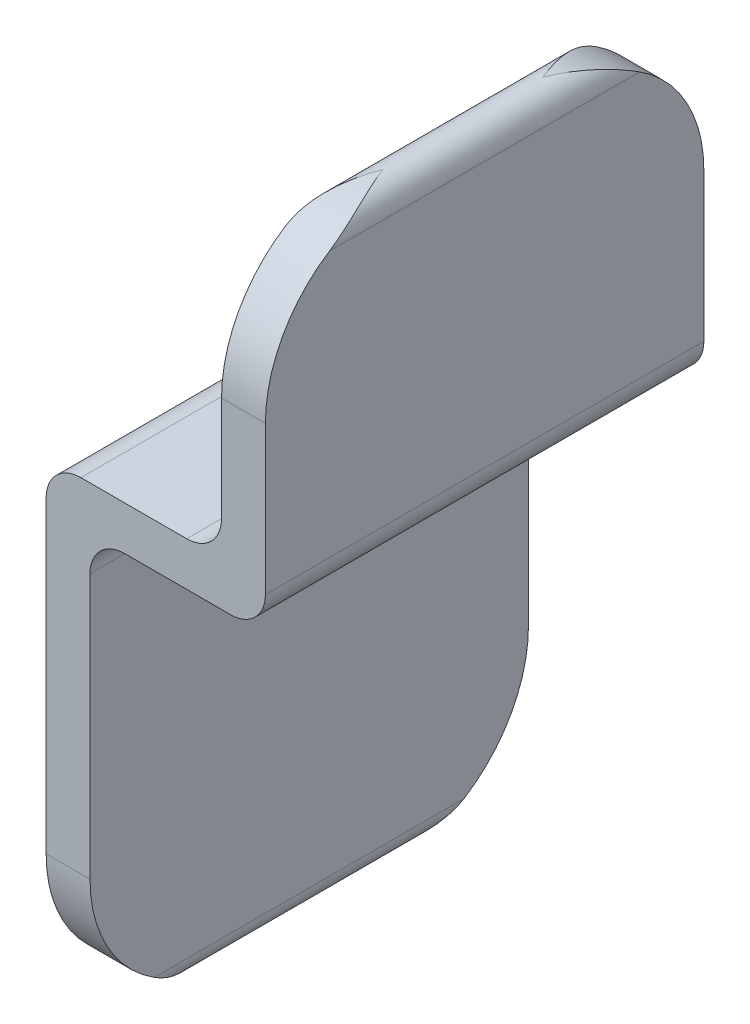
ISO-10303-21;
HEADER;
FILE_DESCRIPTION(('STEP AP214'),'2;1');
FILE_NAME('part.step','',(''),(''),'','','');
FILE_SCHEMA(('AUTOMOTIVE_DESIGN { 1 0 10303 214 1 1 1 1 }'));
ENDSEC;
DATA;
#1=APPLICATION_CONTEXT('core data for automotive mechanical design processes');
#2=APPLICATION_PROTOCOL_DEFINITION('international standard','automotive_design',2000,#1);
#3=PRODUCT_CONTEXT('',#1,'mechanical');
#4=PRODUCT('Part','Part','',(#3));
#5=PRODUCT_RELATED_PRODUCT_CATEGORY('part','',(#4));
#6=PRODUCT_DEFINITION_FORMATION('','',#4);
#7=PRODUCT_DEFINITION_CONTEXT('part definition',#1,'design');
#8=PRODUCT_DEFINITION('design','',#6,#7);
#9=PRODUCT_DEFINITION_SHAPE('','',#8);
#10=(LENGTH_UNIT() NAMED_UNIT(*) SI_UNIT(.MILLI.,.METRE.));
#11=(NAMED_UNIT(*) PLANE_ANGLE_UNIT() SI_UNIT($,.RADIAN.));
#12=(NAMED_UNIT(*) SI_UNIT($,.STERADIAN.) SOLID_ANGLE_UNIT());
#13=UNCERTAINTY_MEASURE_WITH_UNIT(LENGTH_MEASURE(1.E-05),#10,'distance_accuracy_value','');
#14=(GEOMETRIC_REPRESENTATION_CONTEXT(3) GLOBAL_UNCERTAINTY_ASSIGNED_CONTEXT((#13)) GLOBAL_UNIT_ASSIGNED_CONTEXT((#10,
#11,#12)) REPRESENTATION_CONTEXT('',''));
#15=CARTESIAN_POINT('',(0.,0.,0.));
#16=DIRECTION('',(0.,0.,1.));
#17=DIRECTION('',(1.,0.,0.));
#18=AXIS2_PLACEMENT_3D('',#15,#16,#17);
#19=CARTESIAN_POINT('',(-9.,0.,20.));
#20=DIRECTION('',(1.,0.,0.));
#21=DIRECTION('',(0.,1.,0.));
#22=AXIS2_PLACEMENT_3D('',#19,#20,#21);
#23=PLANE('',#22);
#24=DIRECTION('',(0.,-1.,0.));
#25=VECTOR('',#24,1.);
#26=CARTESIAN_POINT('',(-9.,0.,0.));
#27=LINE('',#26,#25);
#28=CARTESIAN_POINT('',(-9.,-13.2875,0.));
#29=VERTEX_POINT('',#28);
#30=CARTESIAN_POINT('',(-9.,-27.35,0.));
#31=VERTEX_POINT('',#30);
#32=EDGE_CURVE('E211',#29,#31,#27,.T.);
#33=ORIENTED_EDGE('',*,*,#32,.T.);
#34=CARTESIAN_POINT('',(-9.,-27.35,6.35));
#35=DIRECTION('',(-1.,0.,0.));
#36=DIRECTION('',(0.,0.,1.));
#37=AXIS2_PLACEMENT_3D('',#34,#35,#36);
#38=CIRCLE('',#37,6.35);
#39=CARTESIAN_POINT('',(-9.,-32.7,2.92947372470259));
#40=VERTEX_POINT('',#39);
#41=EDGE_CURVE('E178',#40,#31,#38,.F.);
#42=ORIENTED_EDGE('',*,*,#41,.F.);
#43=DIRECTION('',(0.,0.,-1.));
#44=VECTOR('',#43,1.);
#45=CARTESIAN_POINT('',(-9.,-32.7,20.));
#46=LINE('',#45,#44);
#47=CARTESIAN_POINT('',(-9.,-32.7,17.0705262752974));
#48=VERTEX_POINT('',#47);
#49=EDGE_CURVE('E176',#48,#40,#46,.T.);
#50=ORIENTED_EDGE('',*,*,#49,.F.);
#51=CARTESIAN_POINT('',(-9.,-27.35,13.65));
#52=DIRECTION('',(-1.,0.,0.));
#53=DIRECTION('',(0.,0.,1.));
#54=AXIS2_PLACEMENT_3D('',#51,#52,#53);
#55=CIRCLE('',#54,6.35);
#56=CARTESIAN_POINT('',(-9.,-27.35,20.));
#57=VERTEX_POINT('',#56);
#58=EDGE_CURVE('E162',#48,#57,#55,.T.);
#59=ORIENTED_EDGE('',*,*,#58,.T.);
#60=DIRECTION('',(0.,-1.,0.));
#61=VECTOR('',#60,1.);
#62=CARTESIAN_POINT('',(-9.,0.,20.));
#63=LINE('',#62,#61);
#64=CARTESIAN_POINT('',(-9.,-13.2875,20.));
#65=VERTEX_POINT('',#64);
#66=EDGE_CURVE('E172',#65,#57,#63,.T.);
#67=ORIENTED_EDGE('',*,*,#66,.F.);
#68=DIRECTION('',(0.,0.,-1.));
#69=VECTOR('',#68,1.);
#70=CARTESIAN_POINT('',(-9.,-13.2875,20.));
#71=LINE('',#70,#69);
#72=EDGE_CURVE('E260',#65,#29,#71,.T.);
#73=ORIENTED_EDGE('',*,*,#72,.T.);
#74=EDGE_LOOP('',(#33,#42,#50,#59,#67,#73));
#75=FACE_BOUND('',#74,.T.);
#76=ADVANCED_FACE('F39',(#75),#23,.F.);
#77=CARTESIAN_POINT('',(-7.99999999999999,-32.7,20.));
#78=DIRECTION('',(0.,0.,-1.));
#79=DIRECTION('',(-1.,0.,0.));
#80=AXIS2_PLACEMENT_3D('',#77,#78,#79);
#81=CYLINDRICAL_SURFACE('',#80,1.);
#82=ORIENTED_EDGE('',*,*,#49,.T.);
#83=CARTESIAN_POINT('',(-9.,-32.7,2.92947372470259));
#84=CARTESIAN_POINT('',(-8.99999409500126,-32.7292952609865,2.97529208532869));
#85=CARTESIAN_POINT('',(-8.99871350748762,-32.7579903410954,3.02147279232449));
#86=CARTESIAN_POINT('',(-8.99386690009227,-32.814123916499,3.11444832539691));
#87=CARTESIAN_POINT('',(-8.9903018713889,-32.84156295124,3.16124287651653));
#88=CARTESIAN_POINT('',(-8.97659589775343,-32.9218199241103,3.30221484685739));
#89=CARTESIAN_POINT('',(-8.9634414774245,-32.9727192644961,3.39720218664429));
#90=CARTESIAN_POINT('',(-8.93083974956432,-33.0689182747726,3.58814487382899));
#91=CARTESIAN_POINT('',(-8.91143005474937,-33.1142492316713,3.68409119479682));
#92=CARTESIAN_POINT('',(-8.86753095969576,-33.1996969962804,3.87720731330863));
#93=CARTESIAN_POINT('',(-8.843037603778,-33.2398097038094,3.97437800792134));
#94=CARTESIAN_POINT('',(-8.7742643863736,-33.3370849925867,4.22748740984281));
#95=CARTESIAN_POINT('',(-8.72686196520115,-33.390259893311,4.38411914656636));
#96=CARTESIAN_POINT('',(-8.62488479525974,-33.4837756210646,4.69885731045467));
#97=CARTESIAN_POINT('',(-8.57030739978809,-33.5241116932336,4.85696426170365));
#98=CARTESIAN_POINT('',(-8.45622374628139,-33.5923479822528,5.17441639287159));
#99=CARTESIAN_POINT('',(-8.39670820839801,-33.6202241265375,5.33376336969916));
#100=CARTESIAN_POINT('',(-8.27479109636742,-33.6636783882047,5.65293645185581));
#101=CARTESIAN_POINT('',(-8.21239073305243,-33.6792616164981,5.81276233030365));
#102=CARTESIAN_POINT('',(-8.10177867186592,-33.695970401157,6.09349068783275));
#103=CARTESIAN_POINT('',(-8.05383190318008,-33.6997008568485,6.2143464982542));
#104=CARTESIAN_POINT('',(-8.00391905093907,-33.6999942388871,6.34012430287521));
#105=CARTESIAN_POINT('',(-8.00195951917024,-33.6999999982983,6.34506216736643));
#106=CARTESIAN_POINT('',(-7.99999999999999,-33.7,6.35));
#107=B_SPLINE_CURVE_WITH_KNOTS('',3,(#83,#84,#85,#86,#87,#88,#89,#90,#91,#92,#93,#94,#95,#96,
#97,#98,#99,#100,#101,#102,#103,#104,#105,#106),.UNSPECIFIED.,.F.,.F.,(4,2,2,2,2,2,2,2,2,2,2,4),
(0.,0.163101314515082,0.326131910148335,0.651407377018209,0.974762367905296,1.29836991622361,
1.81379892159745,2.32941859460209,2.84603018327637,3.36242687180226,3.75244609901472,
3.76838348583197),.UNSPECIFIED.);
#108=CARTESIAN_POINT('',(-7.99999999999999,-33.7,6.35));
#109=VERTEX_POINT('',#108);
#110=EDGE_CURVE('E304',#40,#109,#107,.T.);
#111=ORIENTED_EDGE('',*,*,#110,.T.);
#112=CARTESIAN_POINT('',(-6.99999999999999,-32.7,2.92947372470259));
#113=CARTESIAN_POINT('',(-7.00000590499873,-32.7292952609865,2.97529208532869));
#114=CARTESIAN_POINT('',(-7.00128649251238,-32.7579903410954,3.02147279232449));
#115=CARTESIAN_POINT('',(-7.00613309990772,-32.814123916499,3.11444832539691));
#116=CARTESIAN_POINT('',(-7.00969812861109,-32.84156295124,3.16124287651653));
#117=CARTESIAN_POINT('',(-7.02340410224656,-32.9218199241103,3.30221484685739));
#118=CARTESIAN_POINT('',(-7.03655852257549,-32.9727192644961,3.39720218664429));
#119=CARTESIAN_POINT('',(-7.06916025043567,-33.0689182747726,3.58814487382899));
#120=CARTESIAN_POINT('',(-7.08856994525063,-33.1142492316713,3.68409119479682));
#121=CARTESIAN_POINT('',(-7.13246904030423,-33.1996969962804,3.87720731330863));
#122=CARTESIAN_POINT('',(-7.15696239622199,-33.2398097038094,3.97437800792134));
#123=CARTESIAN_POINT('',(-7.22573561362639,-33.3370849925867,4.22748740984281));
#124=CARTESIAN_POINT('',(-7.27313803479884,-33.390259893311,4.38411914656636));
#125=CARTESIAN_POINT('',(-7.37511520474025,-33.4837756210646,4.69885731045467));
#126=CARTESIAN_POINT('',(-7.4296926002119,-33.5241116932336,4.85696426170365));
#127=CARTESIAN_POINT('',(-7.5437762537186,-33.5923479822528,5.17441639287159));
#128=CARTESIAN_POINT('',(-7.60329179160198,-33.6202241265375,5.33376336969916));
#129=CARTESIAN_POINT('',(-7.72520890363257,-33.6636783882047,5.65293645185581));
#130=CARTESIAN_POINT('',(-7.78760926694756,-33.6792616164981,5.81276233030365));
#131=CARTESIAN_POINT('',(-7.89822132813407,-33.695970401157,6.09349068783275));
#132=CARTESIAN_POINT('',(-7.94616809681991,-33.6997008568485,6.2143464982542));
#133=CARTESIAN_POINT('',(-7.99608094906092,-33.6999942388871,6.34012430287521));
#134=CARTESIAN_POINT('',(-7.99804048082975,-33.6999999982983,6.34506216736643));
#135=CARTESIAN_POINT('',(-7.99999999999999,-33.7,6.35));
#136=B_SPLINE_CURVE_WITH_KNOTS('',3,(#112,#113,#114,#115,#116,#117,#118,#119,#120,#121,#122,
#123,#124,#125,#126,#127,#128,#129,#130,#131,#132,#133,#134,#135),.UNSPECIFIED.,.F.,.F.,(4,2,2,
2,2,2,2,2,2,2,2,4),(0.,0.163101314515081,0.326131910148335,0.651407377018209,0.974762367905296,
1.29836991622361,1.81379892159745,2.32941859460209,2.84603018327637,3.36242687180226,
3.75244609901472,3.76838348583197),.UNSPECIFIED.);
#137=CARTESIAN_POINT('',(-7.,-32.7,2.92947372470259));
#138=VERTEX_POINT('',#137);
#139=EDGE_CURVE('E301',#109,#138,#136,.F.);
#140=ORIENTED_EDGE('',*,*,#139,.T.);
#141=DIRECTION('',(0.,0.,-1.));
#142=VECTOR('',#141,1.);
#143=CARTESIAN_POINT('',(-7.,-32.7,20.));
#144=LINE('',#143,#142);
#145=CARTESIAN_POINT('',(-7.,-32.7,17.0705262752974));
#146=VERTEX_POINT('',#145);
#147=EDGE_CURVE('E256',#146,#138,#144,.T.);
#148=ORIENTED_EDGE('',*,*,#147,.F.);
#149=CARTESIAN_POINT('',(-6.99999999999999,-32.7,17.0705262752974));
#150=CARTESIAN_POINT('',(-7.00000590499873,-32.7292952609865,17.0247079146713));
#151=CARTESIAN_POINT('',(-7.00128649251238,-32.7579903410954,16.9785272076755));
#152=CARTESIAN_POINT('',(-7.00613309990772,-32.814123916499,16.885551674603));
#153=CARTESIAN_POINT('',(-7.00969812861109,-32.84156295124,16.8387571234834));
#154=CARTESIAN_POINT('',(-7.02340410224657,-32.9218199241103,16.6977851531425));
#155=CARTESIAN_POINT('',(-7.0365585225755,-32.9727192644962,16.6027978133556));
#156=CARTESIAN_POINT('',(-7.06916025043569,-33.0689182747727,16.4118551261709));
#157=CARTESIAN_POINT('',(-7.08856994525064,-33.1142492316713,16.3159088052031));
#158=CARTESIAN_POINT('',(-7.13246904030424,-33.1996969962804,16.1227926866913));
#159=CARTESIAN_POINT('',(-7.15696239622199,-33.2398097038094,16.0256219920786));
#160=CARTESIAN_POINT('',(-7.22573561362638,-33.3370849925867,15.7725125901572));
#161=CARTESIAN_POINT('',(-7.27313803479883,-33.390259893311,15.6158808534336));
#162=CARTESIAN_POINT('',(-7.37511520474025,-33.4837756210645,15.3011426895454));
#163=CARTESIAN_POINT('',(-7.42969260021192,-33.5241116932335,15.1430357382964));
#164=CARTESIAN_POINT('',(-7.54377625371855,-33.5923479822528,14.8255836071284));
#165=CARTESIAN_POINT('',(-7.60329179160184,-33.6202241265375,14.6662366303008));
#166=CARTESIAN_POINT('',(-7.72520890363268,-33.6636783882047,14.3470635481443));
#167=CARTESIAN_POINT('',(-7.78760926694801,-33.6792616164981,14.1872376696965));
#168=CARTESIAN_POINT('',(-7.89822132813372,-33.695970401157,13.9065093121671));
#169=CARTESIAN_POINT('',(-7.94616809681876,-33.6997008568485,13.7856535017453));
#170=CARTESIAN_POINT('',(-7.99608094906083,-33.6999942388871,13.6598756971248));
#171=CARTESIAN_POINT('',(-7.9980404808297,-33.6999999982983,13.6549378326335));
#172=CARTESIAN_POINT('',(-7.99999999999999,-33.7,13.65));
#173=B_SPLINE_CURVE_WITH_KNOTS('',3,(#149,#150,#151,#152,#153,#154,#155,#156,#157,#158,#159,
#160,#161,#162,#163,#164,#165,#166,#167,#168,#169,#170,#171,#172),.UNSPECIFIED.,.F.,.F.,(4,2,2,
2,2,2,2,2,2,2,2,4),(0.,0.16310131451512,0.326131910148407,0.651407377018332,0.974762367905358,
1.29836991622361,1.81379892159744,2.32941859460203,2.84603018327634,3.36242687180226,
3.75244609901472,3.76838348583197),.UNSPECIFIED.);
#174=CARTESIAN_POINT('',(-7.99999999999999,-33.7,13.65));
#175=VERTEX_POINT('',#174);
#176=EDGE_CURVE('E334',#175,#146,#173,.F.);
#177=ORIENTED_EDGE('',*,*,#176,.F.);
#178=CARTESIAN_POINT('',(-9.,-32.7,17.0705262752974));
#179=CARTESIAN_POINT('',(-8.99999409500126,-32.7292952609865,17.0247079146713));
#180=CARTESIAN_POINT('',(-8.99871350748762,-32.7579903410954,16.9785272076755));
#181=CARTESIAN_POINT('',(-8.99386690009227,-32.814123916499,16.8855516746031));
#182=CARTESIAN_POINT('',(-8.9903018713889,-32.84156295124,16.8387571234834));
#183=CARTESIAN_POINT('',(-8.97659589775342,-32.9218199241103,16.6977851531425));
#184=CARTESIAN_POINT('',(-8.96344147742449,-32.9727192644962,16.6027978133556));
#185=CARTESIAN_POINT('',(-8.9308397495643,-33.0689182747727,16.4118551261709));
#186=CARTESIAN_POINT('',(-8.91143005474935,-33.1142492316713,16.3159088052031));
#187=CARTESIAN_POINT('',(-8.86753095969575,-33.1996969962804,16.1227926866913));
#188=CARTESIAN_POINT('',(-8.843037603778,-33.2398097038094,16.0256219920786));
#189=CARTESIAN_POINT('',(-8.77426438637361,-33.3370849925867,15.7725125901572));
#190=CARTESIAN_POINT('',(-8.72686196520116,-33.390259893311,15.6158808534336));
#191=CARTESIAN_POINT('',(-8.62488479525974,-33.4837756210645,15.3011426895454));
#192=CARTESIAN_POINT('',(-8.57030739978807,-33.5241116932335,15.1430357382964));
#193=CARTESIAN_POINT('',(-8.45622374628143,-33.5923479822528,14.8255836071284));
#194=CARTESIAN_POINT('',(-8.39670820839815,-33.6202241265375,14.6662366303008));
#195=CARTESIAN_POINT('',(-8.27479109636731,-33.6636783882046,14.3470635481443));
#196=CARTESIAN_POINT('',(-8.212390733052,-33.6792616164981,14.1872376696965));
#197=CARTESIAN_POINT('',(-8.10177867186626,-33.695970401157,13.9065093121671));
#198=CARTESIAN_POINT('',(-8.05383190318119,-33.6997008568485,13.7856535017454));
#199=CARTESIAN_POINT('',(-8.00391905093916,-33.6999942388871,13.6598756971248));
#200=CARTESIAN_POINT('',(-8.00195951917029,-33.6999999982983,13.6549378326336));
#201=CARTESIAN_POINT('',(-7.99999999999999,-33.7,13.65));
#202=B_SPLINE_CURVE_WITH_KNOTS('',3,(#178,#179,#180,#181,#182,#183,#184,#185,#186,#187,#188,
#189,#190,#191,#192,#193,#194,#195,#196,#197,#198,#199,#200,#201),.UNSPECIFIED.,.F.,.F.,(4,2,2,
2,2,2,2,2,2,2,2,4),(0.,0.163101314515117,0.326131910148405,0.651407377018329,0.974762367905352,
1.29836991622361,1.81379892159743,2.32941859460204,2.84603018327634,3.36242687180225,
3.75244609901472,3.76838348583196),.UNSPECIFIED.);
#203=EDGE_CURVE('E212',#48,#175,#202,.T.);
#204=ORIENTED_EDGE('',*,*,#203,.F.);
#205=EDGE_LOOP('',(#82,#111,#140,#148,#177,#204));
#206=FACE_BOUND('',#205,.T.);
#207=ADVANCED_FACE('F324',(#206),#81,.T.);
#208=CARTESIAN_POINT('',(-7.,0.,20.));
#209=DIRECTION('',(1.,0.,0.));
#210=DIRECTION('',(0.,1.,0.));
#211=AXIS2_PLACEMENT_3D('',#208,#209,#210);
#212=PLANE('',#211);
#213=CARTESIAN_POINT('',(-7.,-27.35,6.35));
#214=DIRECTION('',(1.,0.,0.));
#215=DIRECTION('',(0.,1.,0.));
#216=AXIS2_PLACEMENT_3D('',#213,#214,#215);
#217=CIRCLE('',#216,6.35);
#218=CARTESIAN_POINT('',(-7.,-27.35,0.));
#219=VERTEX_POINT('',#218);
#220=EDGE_CURVE('E296',#219,#138,#217,.F.);
#221=ORIENTED_EDGE('',*,*,#220,.F.);
#222=DIRECTION('',(0.,-1.,0.));
#223=VECTOR('',#222,1.);
#224=CARTESIAN_POINT('',(-7.,0.,0.));
#225=LINE('',#224,#223);
#226=CARTESIAN_POINT('',(-7.,-15.2875,0.));
#227=VERTEX_POINT('',#226);
#228=EDGE_CURVE('E214',#227,#219,#225,.T.);
#229=ORIENTED_EDGE('',*,*,#228,.F.);
#230=DIRECTION('',(0.,0.,-1.));
#231=VECTOR('',#230,1.);
#232=CARTESIAN_POINT('',(-7.,-15.2875,20.));
#233=LINE('',#232,#231);
#234=CARTESIAN_POINT('',(-7.,-15.2875,20.));
#235=VERTEX_POINT('',#234);
#236=EDGE_CURVE('E254',#235,#227,#233,.T.);
#237=ORIENTED_EDGE('',*,*,#236,.F.);
#238=DIRECTION('',(0.,-1.,0.));
#239=VECTOR('',#238,1.);
#240=CARTESIAN_POINT('',(-7.,0.,20.));
#241=LINE('',#240,#239);
#242=CARTESIAN_POINT('',(-7.,-27.35,20.));
#243=VERTEX_POINT('',#242);
#244=EDGE_CURVE('E183',#235,#243,#241,.T.);
#245=ORIENTED_EDGE('',*,*,#244,.T.);
#246=CARTESIAN_POINT('',(-7.,-27.35,13.65));
#247=DIRECTION('',(1.,0.,0.));
#248=DIRECTION('',(0.,1.,0.));
#249=AXIS2_PLACEMENT_3D('',#246,#247,#248);
#250=CIRCLE('',#249,6.35);
#251=EDGE_CURVE('E61',#243,#146,#250,.T.);
#252=ORIENTED_EDGE('',*,*,#251,.T.);
#253=ORIENTED_EDGE('',*,*,#147,.T.);
#254=EDGE_LOOP('',(#221,#229,#237,#245,#252,#253));
#255=FACE_BOUND('',#254,.T.);
#256=ADVANCED_FACE('F299',(#255),#212,.T.);
#257=CARTESIAN_POINT('',(1.,0.,20.));
#258=DIRECTION('',(1.,0.,0.));
#259=DIRECTION('',(0.,1.,0.));
#260=AXIS2_PLACEMENT_3D('',#257,#258,#259);
#261=PLANE('',#260);
#262=DIRECTION('',(0.,0.,-1.));
#263=VECTOR('',#262,1.);
#264=CARTESIAN_POINT('',(1.,0.,20.));
#265=LINE('',#264,#263);
#266=CARTESIAN_POINT('',(1.,0.,17.0705262752974));
#267=VERTEX_POINT('',#266);
#268=CARTESIAN_POINT('',(1.,0.,2.92947372470259));
#269=VERTEX_POINT('',#268);
#270=EDGE_CURVE('E244',#267,#269,#265,.T.);
#271=ORIENTED_EDGE('',*,*,#270,.F.);
#272=CARTESIAN_POINT('',(1.,-5.35,13.65));
#273=DIRECTION('',(1.,0.,0.));
#274=DIRECTION('',(0.,1.,0.));
#275=AXIS2_PLACEMENT_3D('',#272,#273,#274);
#276=CIRCLE('',#275,6.35);
#277=CARTESIAN_POINT('',(1.,-5.35,20.));
#278=VERTEX_POINT('',#277);
#279=EDGE_CURVE('E367',#267,#278,#276,.T.);
#280=ORIENTED_EDGE('',*,*,#279,.T.);
#281=DIRECTION('',(0.,-1.,0.));
#282=VECTOR('',#281,1.);
#283=CARTESIAN_POINT('',(1.,0.,20.));
#284=LINE('',#283,#282);
#285=CARTESIAN_POINT('',(1.,-12.1125,20.));
#286=VERTEX_POINT('',#285);
#287=EDGE_CURVE('E199',#278,#286,#284,.T.);
#288=ORIENTED_EDGE('',*,*,#287,.T.);
#289=DIRECTION('',(0.,0.,-1.));
#290=VECTOR('',#289,1.);
#291=CARTESIAN_POINT('',(1.,-12.1125,20.));
#292=LINE('',#291,#290);
#293=CARTESIAN_POINT('',(1.,-12.1125,0.));
#294=VERTEX_POINT('',#293);
#295=EDGE_CURVE('E247',#286,#294,#292,.T.);
#296=ORIENTED_EDGE('',*,*,#295,.T.);
#297=DIRECTION('',(0.,-1.,0.));
#298=VECTOR('',#297,1.);
#299=CARTESIAN_POINT('',(1.,0.,0.));
#300=LINE('',#299,#298);
#301=CARTESIAN_POINT('',(1.,-5.35,0.));
#302=VERTEX_POINT('',#301);
#303=EDGE_CURVE('E226',#302,#294,#300,.T.);
#304=ORIENTED_EDGE('',*,*,#303,.F.);
#305=CARTESIAN_POINT('',(1.,-5.35,6.35));
#306=DIRECTION('',(1.,0.,0.));
#307=DIRECTION('',(0.,1.,0.));
#308=AXIS2_PLACEMENT_3D('',#305,#306,#307);
#309=CIRCLE('',#308,6.35);
#310=EDGE_CURVE('E302',#269,#302,#309,.F.);
#311=ORIENTED_EDGE('',*,*,#310,.F.);
#312=EDGE_LOOP('',(#271,#280,#288,#296,#304,#311));
#313=FACE_BOUND('',#312,.T.);
#314=ADVANCED_FACE('F373',(#313),#261,.T.);
#315=CARTESIAN_POINT('',(0.,0.,20.));
#316=DIRECTION('',(0.,0.,-1.));
#317=DIRECTION('',(-1.,0.,0.));
#318=AXIS2_PLACEMENT_3D('',#315,#316,#317);
#319=CYLINDRICAL_SURFACE('',#318,1.);
#320=DIRECTION('',(0.,0.,-1.));
#321=VECTOR('',#320,1.);
#322=CARTESIAN_POINT('',(-1.,0.,20.));
#323=LINE('',#322,#321);
#324=CARTESIAN_POINT('',(-1.,0.,17.0705262752974));
#325=VERTEX_POINT('',#324);
#326=CARTESIAN_POINT('',(-1.,0.,2.92947372470259));
#327=VERTEX_POINT('',#326);
#328=EDGE_CURVE('E241',#325,#327,#323,.T.);
#329=ORIENTED_EDGE('',*,*,#328,.F.);
#330=CARTESIAN_POINT('',(-1.,0.,17.0705262752974));
#331=CARTESIAN_POINT('',(-0.999994095001265,0.0292952609865041,17.0247079146713));
#332=CARTESIAN_POINT('',(-0.998713507487621,0.0579903410953998,16.9785272076756));
#333=CARTESIAN_POINT('',(-0.993866900092283,0.114123916498952,16.8855516746032));
#334=CARTESIAN_POINT('',(-0.990301871388917,0.141562951239895,16.8387571234836));
#335=CARTESIAN_POINT('',(-0.97659589775345,0.221819924110178,16.6977851531428));
#336=CARTESIAN_POINT('',(-0.963441477424532,0.27271926449601,16.6027978133559));
#337=CARTESIAN_POINT('',(-0.93083974956436,0.368918274772557,16.4118551261712));
#338=CARTESIAN_POINT('',(-0.911430054749401,0.414249231671199,16.3159088052033));
#339=CARTESIAN_POINT('',(-0.867530959695783,0.499696996280342,16.1227926866914));
#340=CARTESIAN_POINT('',(-0.843037603778016,0.539809703809364,16.0256219920787));
#341=CARTESIAN_POINT('',(-0.774264386373599,0.637084992586732,15.7725125901572));
#342=CARTESIAN_POINT('',(-0.726861965201129,0.690259893310973,15.6158808534336));
#343=CARTESIAN_POINT('',(-0.62488479525974,0.783775621064577,15.3011426895453));
#344=CARTESIAN_POINT('',(-0.570307399788137,0.824111693233576,15.1430357382962));
#345=CARTESIAN_POINT('',(-0.456223746281286,0.892347982252806,14.8255836071283));
#346=CARTESIAN_POINT('',(-0.396708208397728,0.920224126537516,14.6662366303009));
#347=CARTESIAN_POINT('',(-0.274791096367661,0.963678388204657,14.347063548144));
#348=CARTESIAN_POINT('',(-0.212390733053388,0.97926161649807,14.1872376696959));
#349=CARTESIAN_POINT('',(-0.101778671865186,0.995970401156981,13.9065093121675));
#350=CARTESIAN_POINT('',(-0.0538319031776566,0.999700856848545,13.7856535017468));
#351=CARTESIAN_POINT('',(-0.0039190509388797,0.999994238887093,13.6598756971249));
#352=CARTESIAN_POINT('',(-0.00195951917014393,0.999999998298322,13.6549378326336));
#353=CARTESIAN_POINT('',(0.,1.,13.65));
#354=B_SPLINE_CURVE_WITH_KNOTS('',3,(#330,#331,#332,#333,#334,#335,#336,#337,#338,#339,#340,
#341,#342,#343,#344,#345,#346,#347,#348,#349,#350,#351,#352,#353),.UNSPECIFIED.,.F.,.F.,(4,2,2,
2,2,2,2,2,2,2,2,4),(0.,0.163101314515015,0.326131910148194,0.65140737701795,0.974762367905178,
1.29836991622362,1.81379892159749,2.3294185946022,2.84603018327644,3.36242687180226,
3.75244609901472,3.76838348583197),.UNSPECIFIED.);
#355=CARTESIAN_POINT('',(0.,1.,13.65));
#356=VERTEX_POINT('',#355);
#357=EDGE_CURVE('E354',#325,#356,#354,.T.);
#358=ORIENTED_EDGE('',*,*,#357,.T.);
#359=CARTESIAN_POINT('',(1.,0.,17.0705262752974));
#360=CARTESIAN_POINT('',(0.999994095001265,0.0292952609865062,17.0247079146713));
#361=CARTESIAN_POINT('',(0.99871350748762,0.0579903410954035,16.9785272076755));
#362=CARTESIAN_POINT('',(0.993866900092282,0.114123916498961,16.8855516746032));
#363=CARTESIAN_POINT('',(0.990301871388916,0.141562951239908,16.8387571234835));
#364=CARTESIAN_POINT('',(0.976595897753446,0.221819924110199,16.6977851531427));
#365=CARTESIAN_POINT('',(0.963441477424526,0.272719264496034,16.6027978133558));
#366=CARTESIAN_POINT('',(0.930839749564352,0.368918274772578,16.4118551261712));
#367=CARTESIAN_POINT('',(0.911430054749393,0.414249231671216,16.3159088052033));
#368=CARTESIAN_POINT('',(0.867530959695778,0.499696996280349,16.1227926866914));
#369=CARTESIAN_POINT('',(0.843037603778013,0.539809703809367,16.0256219920787));
#370=CARTESIAN_POINT('',(0.774264386373601,0.63708499258673,15.7725125901572));
#371=CARTESIAN_POINT('',(0.726861965201134,0.690259893310971,15.6158808534336));
#372=CARTESIAN_POINT('',(0.624884795259739,0.783775621064573,15.3011426895453));
#373=CARTESIAN_POINT('',(0.570307399788127,0.824111693233571,15.1430357382963));
#374=CARTESIAN_POINT('',(0.456223746281312,0.892347982252801,14.8255836071284));
#375=CARTESIAN_POINT('',(0.396708208397798,0.920224126537512,14.6662366303009));
#376=CARTESIAN_POINT('',(0.274791096367605,0.963678388204656,14.3470635481441));
#377=CARTESIAN_POINT('',(0.212390733053161,0.979261616498069,14.187237669696));
#378=CARTESIAN_POINT('',(0.10177867186537,0.995970401156979,13.9065093121675));
#379=CARTESIAN_POINT('',(0.053831903178248,0.999700856848541,13.7856535017465));
#380=CARTESIAN_POINT('',(0.00391905093892742,0.999994238887093,13.6598756971249));
#381=CARTESIAN_POINT('',(0.00195951917016861,0.999999998298322,13.6549378326336));
#382=CARTESIAN_POINT('',(0.,1.,13.65));
#383=B_SPLINE_CURVE_WITH_KNOTS('',3,(#359,#360,#361,#362,#363,#364,#365,#366,#367,#368,#369,
#370,#371,#372,#373,#374,#375,#376,#377,#378,#379,#380,#381,#382),.UNSPECIFIED.,.F.,.F.,(4,2,2,
2,2,2,2,2,2,2,2,4),(0.,0.163101314515023,0.326131910148226,0.651407377018012,0.974762367905209,
1.29836991622362,1.81379892159748,2.32941859460217,2.84603018327642,3.36242687180225,
3.75244609901472,3.76838348583197),.UNSPECIFIED.);
#384=EDGE_CURVE('E361',#356,#267,#383,.F.);
#385=ORIENTED_EDGE('',*,*,#384,.T.);
#386=ORIENTED_EDGE('',*,*,#270,.T.);
#387=CARTESIAN_POINT('',(1.,0.,2.92947372470259));
#388=CARTESIAN_POINT('',(0.999994095001265,0.0292952609865208,2.9752920853287));
#389=CARTESIAN_POINT('',(0.998713507487619,0.0579903410954329,3.0214727923245));
#390=CARTESIAN_POINT('',(0.993866900092276,0.114123916499018,3.11444832539694));
#391=CARTESIAN_POINT('',(0.990301871388906,0.141562951239978,3.16124287651658));
#392=CARTESIAN_POINT('',(0.976595897753424,0.2218199241103,3.30221484685745));
#393=CARTESIAN_POINT('',(0.963441477424493,0.272719264496152,3.39720218664437));
#394=CARTESIAN_POINT('',(0.930839749564309,0.368918274772682,3.58814487382907));
#395=CARTESIAN_POINT('',(0.911430054749357,0.414249231671294,3.68409119479688));
#396=CARTESIAN_POINT('',(0.867530959695756,0.499696996280383,3.87720731330866));
#397=CARTESIAN_POINT('',(0.843037603778,0.539809703809383,3.97437800792136));
#398=CARTESIAN_POINT('',(0.774264386373609,0.637084992586725,4.22748740984281));
#399=CARTESIAN_POINT('',(0.726861965201164,0.690259893310962,4.38411914656636));
#400=CARTESIAN_POINT('',(0.62488479525974,0.783775621064555,4.69885731045465));
#401=CARTESIAN_POINT('',(0.57030739978808,0.824111693233549,4.85696426170362));
#402=CARTESIAN_POINT('',(0.456223746281428,0.892347982252782,5.17441639287158));
#403=CARTESIAN_POINT('',(0.396708208398126,0.920224126537498,5.33376336969917));
#404=CARTESIAN_POINT('',(0.274791096367328,0.963678388204652,5.65293645185576));
#405=CARTESIAN_POINT('',(0.212390733052068,0.979261616498071,5.81276233030351));
#406=CARTESIAN_POINT('',(0.101778671866212,0.995970401156976,6.09349068783287));
#407=CARTESIAN_POINT('',(0.0538319031810194,0.999700856848531,6.21434649825457));
#408=CARTESIAN_POINT('',(0.00391905093914989,0.999994238887091,6.34012430287524));
#409=CARTESIAN_POINT('',(0.00195951917028368,0.99999999829832,6.34506216736645));
#410=CARTESIAN_POINT('',(0.,1.,6.35));
#411=B_SPLINE_CURVE_WITH_KNOTS('',3,(#387,#388,#389,#390,#391,#392,#393,#394,#395,#396,#397,
#398,#399,#400,#401,#402,#403,#404,#405,#406,#407,#408,#409,#410),.UNSPECIFIED.,.F.,.F.,(4,2,2,
2,2,2,2,2,2,2,2,4),(0.,0.16310131451511,0.326131910148392,0.651407377018313,0.974762367905348,
1.29836991622362,1.81379892159744,2.32941859460205,2.84603018327635,3.36242687180226,
3.75244609901472,3.76838348583197),.UNSPECIFIED.);
#412=CARTESIAN_POINT('',(0.,0.999999999999999,6.35));
#413=VERTEX_POINT('',#412);
#414=EDGE_CURVE('E306',#413,#269,#411,.F.);
#415=ORIENTED_EDGE('',*,*,#414,.F.);
#416=CARTESIAN_POINT('',(-1.,0.,2.92947372470259));
#417=CARTESIAN_POINT('',(-0.999994095001265,0.0292952609865122,2.97529208532868));
#418=CARTESIAN_POINT('',(-0.99871350748762,0.0579903410954157,3.02147279232447));
#419=CARTESIAN_POINT('',(-0.99386690009228,0.114123916498984,3.11444832539689));
#420=CARTESIAN_POINT('',(-0.990301871388912,0.141562951239936,3.1612428765165));
#421=CARTESIAN_POINT('',(-0.976595897753437,0.221819924110239,3.30221484685734));
#422=CARTESIAN_POINT('',(-0.963441477424513,0.272719264496081,3.39720218664424));
#423=CARTESIAN_POINT('',(-0.930839749564335,0.36891827477262,3.58814487382894));
#424=CARTESIAN_POINT('',(-0.91143005474938,0.414249231671246,3.68409119479678));
#425=CARTESIAN_POINT('',(-0.86753095969577,0.499696996280362,3.87720731330861));
#426=CARTESIAN_POINT('',(-0.843037603778008,0.539809703809373,3.97437800792134));
#427=CARTESIAN_POINT('',(-0.774264386373604,0.637084992586729,4.22748740984281));
#428=CARTESIAN_POINT('',(-0.726861965201147,0.690259893310967,4.38411914656637));
#429=CARTESIAN_POINT('',(-0.62488479525974,0.783775621064565,4.6988573104547));
#430=CARTESIAN_POINT('',(-0.570307399788108,0.824111693233562,4.85696426170369));
#431=CARTESIAN_POINT('',(-0.456223746281358,0.892347982252794,5.17441639287162));
#432=CARTESIAN_POINT('',(-0.396708208397929,0.920224126537506,5.33376336969916));
#433=CARTESIAN_POINT('',(-0.274791096367499,0.963678388204653,5.65293645185586));
#434=CARTESIAN_POINT('',(-0.212390733052733,0.979261616498068,5.81276233030379));
#435=CARTESIAN_POINT('',(-0.101778671865708,0.995970401156978,6.09349068783267));
#436=CARTESIAN_POINT('',(-0.053831903179351,0.99970085684854,6.21434649825391));
#437=CARTESIAN_POINT('',(-0.00391905093901583,0.999994238887092,6.34012430287518));
#438=CARTESIAN_POINT('',(-0.00195951917021433,0.999999998298321,6.34506216736642));
#439=CARTESIAN_POINT('',(0.,1.,6.35));
#440=B_SPLINE_CURVE_WITH_KNOTS('',3,(#416,#417,#418,#419,#420,#421,#422,#423,#424,#425,#426,
#427,#428,#429,#430,#431,#432,#433,#434,#435,#436,#437,#438,#439),.UNSPECIFIED.,.F.,.F.,(4,2,2,
2,2,2,2,2,2,2,2,4),(0.,0.16310131451506,0.326131910148293,0.651407377018133,0.974762367905263,
1.29836991622362,1.81379892159747,2.32941859460213,2.8460301832764,3.36242687180227,
3.75244609901472,3.76838348583197),.UNSPECIFIED.);
#441=EDGE_CURVE('E380',#327,#413,#440,.T.);
#442=ORIENTED_EDGE('',*,*,#441,.F.);
#443=EDGE_LOOP('',(#329,#358,#385,#386,#415,#442));
#444=FACE_BOUND('',#443,.T.);
#445=ADVANCED_FACE('F368',(#444),#319,.T.);
#446=CARTESIAN_POINT('',(-1.,0.,20.));
#447=DIRECTION('',(1.,0.,0.));
#448=DIRECTION('',(0.,1.,0.));
#449=AXIS2_PLACEMENT_3D('',#446,#447,#448);
#450=PLANE('',#449);
#451=CARTESIAN_POINT('',(-1.,-5.35,13.65));
#452=DIRECTION('',(1.,0.,0.));
#453=DIRECTION('',(0.,1.,0.));
#454=AXIS2_PLACEMENT_3D('',#451,#452,#453);
#455=CIRCLE('',#454,6.35);
#456=CARTESIAN_POINT('',(-0.999999999999999,-5.35,20.));
#457=VERTEX_POINT('',#456);
#458=EDGE_CURVE('E54',#325,#457,#455,.T.);
#459=ORIENTED_EDGE('',*,*,#458,.F.);
#460=ORIENTED_EDGE('',*,*,#328,.T.);
#461=CARTESIAN_POINT('',(-1.,-5.35,6.35));
#462=DIRECTION('',(1.,0.,0.));
#463=DIRECTION('',(0.,1.,0.));
#464=AXIS2_PLACEMENT_3D('',#461,#462,#463);
#465=CIRCLE('',#464,6.35);
#466=CARTESIAN_POINT('',(-1.,-5.35,0.));
#467=VERTEX_POINT('',#466);
#468=EDGE_CURVE('E177',#327,#467,#465,.F.);
#469=ORIENTED_EDGE('',*,*,#468,.T.);
#470=DIRECTION('',(0.,-1.,0.));
#471=VECTOR('',#470,1.);
#472=CARTESIAN_POINT('',(-1.,0.,0.));
#473=LINE('',#472,#471);
#474=CARTESIAN_POINT('',(-0.999999999999999,-10.1125,0.));
#475=VERTEX_POINT('',#474);
#476=EDGE_CURVE('E228',#467,#475,#473,.T.);
#477=ORIENTED_EDGE('',*,*,#476,.T.);
#478=DIRECTION('',(0.,0.,-1.));
#479=VECTOR('',#478,1.);
#480=CARTESIAN_POINT('',(-0.999999999999999,-10.1125,20.));
#481=LINE('',#480,#479);
#482=CARTESIAN_POINT('',(-0.999999999999999,-10.1125,20.));
#483=VERTEX_POINT('',#482);
#484=EDGE_CURVE('E238',#483,#475,#481,.T.);
#485=ORIENTED_EDGE('',*,*,#484,.F.);
#486=DIRECTION('',(0.,-1.,0.));
#487=VECTOR('',#486,1.);
#488=CARTESIAN_POINT('',(-1.,0.,20.));
#489=LINE('',#488,#487);
#490=EDGE_CURVE('E201',#457,#483,#489,.T.);
#491=ORIENTED_EDGE('',*,*,#490,.F.);
#492=EDGE_LOOP('',(#459,#460,#469,#477,#485,#491));
#493=FACE_BOUND('',#492,.T.);
#494=ADVANCED_FACE('F272',(#493),#450,.F.);
#495=CARTESIAN_POINT('',(0.,0.,20.));
#496=DIRECTION('',(0.,0.,1.));
#497=DIRECTION('',(1.,0.,0.));
#498=AXIS2_PLACEMENT_3D('',#495,#496,#497);
#499=PLANE('',#498);
#500=DIRECTION('',(-1.,0.,0.));
#501=VECTOR('',#500,1.);
#502=CARTESIAN_POINT('',(46.,-27.35,20.));
#503=LINE('',#502,#501);
#504=EDGE_CURVE('E11',#243,#57,#503,.T.);
#505=ORIENTED_EDGE('',*,*,#504,.F.);
#506=ORIENTED_EDGE('',*,*,#244,.F.);
#507=CARTESIAN_POINT('',(-5.4125,-15.2875,20.));
#508=DIRECTION('',(0.,0.,1.));
#509=DIRECTION('',(1.,0.,0.));
#510=AXIS2_PLACEMENT_3D('',#507,#508,#509);
#511=CIRCLE('',#510,1.5875);
#512=CARTESIAN_POINT('',(-5.4125,-13.7,20.));
#513=VERTEX_POINT('',#512);
#514=EDGE_CURVE('E185',#513,#235,#511,.T.);
#515=ORIENTED_EDGE('',*,*,#514,.F.);
#516=DIRECTION('',(-1.,0.,0.));
#517=VECTOR('',#516,1.);
#518=CARTESIAN_POINT('',(0.,-13.7,20.));
#519=LINE('',#518,#517);
#520=CARTESIAN_POINT('',(-0.587499999999998,-13.7,20.));
#521=VERTEX_POINT('',#520);
#522=EDGE_CURVE('E193',#521,#513,#519,.T.);
#523=ORIENTED_EDGE('',*,*,#522,.F.);
#524=CARTESIAN_POINT('',(-0.587499999999998,-12.1125,20.));
#525=DIRECTION('',(0.,0.,1.));
#526=DIRECTION('',(1.,0.,0.));
#527=AXIS2_PLACEMENT_3D('',#524,#525,#526);
#528=CIRCLE('',#527,1.5875);
#529=EDGE_CURVE('E196',#286,#521,#528,.F.);
#530=ORIENTED_EDGE('',*,*,#529,.F.);
#531=ORIENTED_EDGE('',*,*,#287,.F.);
#532=DIRECTION('',(-1.,0.,0.));
#533=VECTOR('',#532,1.);
#534=CARTESIAN_POINT('',(46.,-5.35,20.));
#535=LINE('',#534,#533);
#536=EDGE_CURVE('E47',#278,#457,#535,.T.);
#537=ORIENTED_EDGE('',*,*,#536,.T.);
#538=ORIENTED_EDGE('',*,*,#490,.T.);
#539=CARTESIAN_POINT('',(-2.5875,-10.1125,20.));
#540=DIRECTION('',(0.,0.,1.));
#541=DIRECTION('',(1.,0.,0.));
#542=AXIS2_PLACEMENT_3D('',#539,#540,#541);
#543=CIRCLE('',#542,1.5875);
#544=CARTESIAN_POINT('',(-2.5875,-11.7,20.));
#545=VERTEX_POINT('',#544);
#546=EDGE_CURVE('E203',#483,#545,#543,.F.);
#547=ORIENTED_EDGE('',*,*,#546,.T.);
#548=DIRECTION('',(-1.,0.,0.));
#549=VECTOR('',#548,1.);
#550=CARTESIAN_POINT('',(0.,-11.7,20.));
#551=LINE('',#550,#549);
#552=CARTESIAN_POINT('',(-7.4125,-11.7,20.));
#553=VERTEX_POINT('',#552);
#554=EDGE_CURVE('E205',#545,#553,#551,.T.);
#555=ORIENTED_EDGE('',*,*,#554,.T.);
#556=CARTESIAN_POINT('',(-7.4125,-13.2875,20.));
#557=DIRECTION('',(0.,0.,1.));
#558=DIRECTION('',(1.,0.,0.));
#559=AXIS2_PLACEMENT_3D('',#556,#557,#558);
#560=CIRCLE('',#559,1.5875);
#561=EDGE_CURVE('E182',#65,#553,#560,.F.);
#562=ORIENTED_EDGE('',*,*,#561,.F.);
#563=ORIENTED_EDGE('',*,*,#66,.T.);
#564=EDGE_LOOP('',(#505,#506,#515,#523,#530,#531,#537,#538,#547,#555,#562,#563));
#565=FACE_BOUND('',#564,.T.);
#566=ADVANCED_FACE('F180',(#565),#499,.T.);
#567=CARTESIAN_POINT('',(0.,0.,0.));
#568=DIRECTION('',(0.,0.,1.));
#569=DIRECTION('',(1.,0.,0.));
#570=AXIS2_PLACEMENT_3D('',#567,#568,#569);
#571=PLANE('',#570);
#572=DIRECTION('',(-1.,0.,0.));
#573=VECTOR('',#572,1.);
#574=CARTESIAN_POINT('',(46.,-27.35,0.));
#575=LINE('',#574,#573);
#576=EDGE_CURVE('E265',#31,#219,#575,.F.);
#577=ORIENTED_EDGE('',*,*,#576,.F.);
#578=ORIENTED_EDGE('',*,*,#32,.F.);
#579=CARTESIAN_POINT('',(-7.4125,-13.2875,0.));
#580=DIRECTION('',(0.,0.,1.));
#581=DIRECTION('',(1.,0.,0.));
#582=AXIS2_PLACEMENT_3D('',#579,#580,#581);
#583=CIRCLE('',#582,1.5875);
#584=CARTESIAN_POINT('',(-7.4125,-11.7,0.));
#585=VERTEX_POINT('',#584);
#586=EDGE_CURVE('E208',#29,#585,#583,.F.);
#587=ORIENTED_EDGE('',*,*,#586,.T.);
#588=DIRECTION('',(-1.,0.,0.));
#589=VECTOR('',#588,1.);
#590=CARTESIAN_POINT('',(0.,-11.7,0.));
#591=LINE('',#590,#589);
#592=CARTESIAN_POINT('',(-2.5875,-11.7,0.));
#593=VERTEX_POINT('',#592);
#594=EDGE_CURVE('E187',#593,#585,#591,.T.);
#595=ORIENTED_EDGE('',*,*,#594,.F.);
#596=CARTESIAN_POINT('',(-2.5875,-10.1125,0.));
#597=DIRECTION('',(0.,0.,1.));
#598=DIRECTION('',(1.,0.,0.));
#599=AXIS2_PLACEMENT_3D('',#596,#597,#598);
#600=CIRCLE('',#599,1.5875);
#601=EDGE_CURVE('E230',#475,#593,#600,.F.);
#602=ORIENTED_EDGE('',*,*,#601,.F.);
#603=ORIENTED_EDGE('',*,*,#476,.F.);
#604=DIRECTION('',(-1.,0.,0.));
#605=VECTOR('',#604,1.);
#606=CARTESIAN_POINT('',(46.,-5.35,0.));
#607=LINE('',#606,#605);
#608=EDGE_CURVE('E262',#467,#302,#607,.F.);
#609=ORIENTED_EDGE('',*,*,#608,.T.);
#610=ORIENTED_EDGE('',*,*,#303,.T.);
#611=CARTESIAN_POINT('',(-0.587499999999998,-12.1125,0.));
#612=DIRECTION('',(0.,0.,1.));
#613=DIRECTION('',(1.,0.,0.));
#614=AXIS2_PLACEMENT_3D('',#611,#612,#613);
#615=CIRCLE('',#614,1.5875);
#616=CARTESIAN_POINT('',(-0.587499999999998,-13.7,0.));
#617=VERTEX_POINT('',#616);
#618=EDGE_CURVE('E223',#294,#617,#615,.F.);
#619=ORIENTED_EDGE('',*,*,#618,.T.);
#620=DIRECTION('',(-1.,0.,0.));
#621=VECTOR('',#620,1.);
#622=CARTESIAN_POINT('',(0.,-13.7,0.));
#623=LINE('',#622,#621);
#624=CARTESIAN_POINT('',(-5.4125,-13.7,0.));
#625=VERTEX_POINT('',#624);
#626=EDGE_CURVE('E220',#617,#625,#623,.T.);
#627=ORIENTED_EDGE('',*,*,#626,.T.);
#628=CARTESIAN_POINT('',(-5.4125,-15.2875,0.));
#629=DIRECTION('',(0.,0.,1.));
#630=DIRECTION('',(1.,0.,0.));
#631=AXIS2_PLACEMENT_3D('',#628,#629,#630);
#632=CIRCLE('',#631,1.5875);
#633=EDGE_CURVE('E217',#625,#227,#632,.T.);
#634=ORIENTED_EDGE('',*,*,#633,.T.);
#635=ORIENTED_EDGE('',*,*,#228,.T.);
#636=EDGE_LOOP('',(#577,#578,#587,#595,#602,#603,#609,#610,#619,#627,#634,#635));
#637=FACE_BOUND('',#636,.T.);
#638=ADVANCED_FACE('F291',(#637),#571,.F.);
#639=CARTESIAN_POINT('',(-7.4125,-13.2875,20.));
#640=DIRECTION('',(0.,0.,-1.));
#641=DIRECTION('',(-1.,0.,0.));
#642=AXIS2_PLACEMENT_3D('',#639,#640,#641);
#643=CYLINDRICAL_SURFACE('',#642,1.5875);
#644=ORIENTED_EDGE('',*,*,#586,.F.);
#645=ORIENTED_EDGE('',*,*,#72,.F.);
#646=ORIENTED_EDGE('',*,*,#561,.T.);
#647=DIRECTION('',(0.,0.,-1.));
#648=VECTOR('',#647,1.);
#649=CARTESIAN_POINT('',(-7.4125,-11.7,20.));
#650=LINE('',#649,#648);
#651=EDGE_CURVE('E207',#553,#585,#650,.T.);
#652=ORIENTED_EDGE('',*,*,#651,.T.);
#653=EDGE_LOOP('',(#644,#645,#646,#652));
#654=FACE_BOUND('',#653,.T.);
#655=ADVANCED_FACE('F41',(#654),#643,.T.);
#656=CARTESIAN_POINT('',(-5.4125,-15.2875,20.));
#657=DIRECTION('',(0.,0.,-1.));
#658=DIRECTION('',(-1.,0.,0.));
#659=AXIS2_PLACEMENT_3D('',#656,#657,#658);
#660=CYLINDRICAL_SURFACE('',#659,1.5875);
#661=ORIENTED_EDGE('',*,*,#633,.F.);
#662=DIRECTION('',(0.,0.,-1.));
#663=VECTOR('',#662,1.);
#664=CARTESIAN_POINT('',(-5.4125,-13.7,20.));
#665=LINE('',#664,#663);
#666=EDGE_CURVE('E252',#513,#625,#665,.T.);
#667=ORIENTED_EDGE('',*,*,#666,.F.);
#668=ORIENTED_EDGE('',*,*,#514,.T.);
#669=ORIENTED_EDGE('',*,*,#236,.T.);
#670=EDGE_LOOP('',(#661,#667,#668,#669));
#671=FACE_BOUND('',#670,.T.);
#672=ADVANCED_FACE('F452',(#671),#660,.F.);
#673=CARTESIAN_POINT('',(0.,-13.7,20.));
#674=DIRECTION('',(0.,-1.,0.));
#675=DIRECTION('',(1.,0.,0.));
#676=AXIS2_PLACEMENT_3D('',#673,#674,#675);
#677=PLANE('',#676);
#678=ORIENTED_EDGE('',*,*,#626,.F.);
#679=DIRECTION('',(0.,0.,-1.));
#680=VECTOR('',#679,1.);
#681=CARTESIAN_POINT('',(-0.587499999999998,-13.7,20.));
#682=LINE('',#681,#680);
#683=EDGE_CURVE('E250',#521,#617,#682,.T.);
#684=ORIENTED_EDGE('',*,*,#683,.F.);
#685=ORIENTED_EDGE('',*,*,#522,.T.);
#686=ORIENTED_EDGE('',*,*,#666,.T.);
#687=EDGE_LOOP('',(#678,#684,#685,#686));
#688=FACE_BOUND('',#687,.T.);
#689=ADVANCED_FACE('F407',(#688),#677,.T.);
#690=CARTESIAN_POINT('',(-0.587499999999998,-12.1125,20.));
#691=DIRECTION('',(0.,0.,-1.));
#692=DIRECTION('',(-1.,0.,0.));
#693=AXIS2_PLACEMENT_3D('',#690,#691,#692);
#694=CYLINDRICAL_SURFACE('',#693,1.5875);
#695=ORIENTED_EDGE('',*,*,#618,.F.);
#696=ORIENTED_EDGE('',*,*,#295,.F.);
#697=ORIENTED_EDGE('',*,*,#529,.T.);
#698=ORIENTED_EDGE('',*,*,#683,.T.);
#699=EDGE_LOOP('',(#695,#696,#697,#698));
#700=FACE_BOUND('',#699,.T.);
#701=ADVANCED_FACE('F403',(#700),#694,.T.);
#702=CARTESIAN_POINT('',(-2.5875,-10.1125,20.));
#703=DIRECTION('',(0.,0.,-1.));
#704=DIRECTION('',(-1.,0.,0.));
#705=AXIS2_PLACEMENT_3D('',#702,#703,#704);
#706=CYLINDRICAL_SURFACE('',#705,1.5875);
#707=ORIENTED_EDGE('',*,*,#601,.T.);
#708=DIRECTION('',(0.,0.,-1.));
#709=VECTOR('',#708,1.);
#710=CARTESIAN_POINT('',(-2.5875,-11.7,20.));
#711=LINE('',#710,#709);
#712=EDGE_CURVE('E235',#545,#593,#711,.T.);
#713=ORIENTED_EDGE('',*,*,#712,.F.);
#714=ORIENTED_EDGE('',*,*,#546,.F.);
#715=ORIENTED_EDGE('',*,*,#484,.T.);
#716=EDGE_LOOP('',(#707,#713,#714,#715));
#717=FACE_BOUND('',#716,.T.);
#718=ADVANCED_FACE('F280',(#717),#706,.F.);
#719=CARTESIAN_POINT('',(0.,-11.7,20.));
#720=DIRECTION('',(0.,-1.,0.));
#721=DIRECTION('',(1.,0.,0.));
#722=AXIS2_PLACEMENT_3D('',#719,#720,#721);
#723=PLANE('',#722);
#724=ORIENTED_EDGE('',*,*,#594,.T.);
#725=ORIENTED_EDGE('',*,*,#651,.F.);
#726=ORIENTED_EDGE('',*,*,#554,.F.);
#727=ORIENTED_EDGE('',*,*,#712,.T.);
#728=EDGE_LOOP('',(#724,#725,#726,#727));
#729=FACE_BOUND('',#728,.T.);
#730=ADVANCED_FACE('F284',(#729),#723,.F.);
#731=CARTESIAN_POINT('',(46.,-5.35,6.35));
#732=DIRECTION('',(-1.,0.,0.));
#733=DIRECTION('',(0.,-1.,0.));
#734=AXIS2_PLACEMENT_3D('',#731,#732,#733);
#735=CYLINDRICAL_SURFACE('',#734,6.35);
#736=ORIENTED_EDGE('',*,*,#310,.T.);
#737=ORIENTED_EDGE('',*,*,#608,.F.);
#738=ORIENTED_EDGE('',*,*,#468,.F.);
#739=ORIENTED_EDGE('',*,*,#441,.T.);
#740=ORIENTED_EDGE('',*,*,#414,.T.);
#741=EDGE_LOOP('',(#736,#737,#738,#739,#740));
#742=FACE_BOUND('',#741,.T.);
#743=ADVANCED_FACE('F391',(#742),#735,.T.);
#744=CARTESIAN_POINT('',(46.,-27.35,6.35));
#745=DIRECTION('',(-1.,0.,0.));
#746=DIRECTION('',(0.,-1.,0.));
#747=AXIS2_PLACEMENT_3D('',#744,#745,#746);
#748=CYLINDRICAL_SURFACE('',#747,6.35);
#749=ORIENTED_EDGE('',*,*,#41,.T.);
#750=ORIENTED_EDGE('',*,*,#576,.T.);
#751=ORIENTED_EDGE('',*,*,#220,.T.);
#752=ORIENTED_EDGE('',*,*,#139,.F.);
#753=ORIENTED_EDGE('',*,*,#110,.F.);
#754=EDGE_LOOP('',(#749,#750,#751,#752,#753));
#755=FACE_BOUND('',#754,.T.);
#756=ADVANCED_FACE('F295',(#755),#748,.T.);
#757=CARTESIAN_POINT('',(46.,-5.35,13.65));
#758=DIRECTION('',(-1.,0.,0.));
#759=DIRECTION('',(0.,-1.,0.));
#760=AXIS2_PLACEMENT_3D('',#757,#758,#759);
#761=CYLINDRICAL_SURFACE('',#760,6.35);
#762=ORIENTED_EDGE('',*,*,#384,.F.);
#763=ORIENTED_EDGE('',*,*,#357,.F.);
#764=ORIENTED_EDGE('',*,*,#458,.T.);
#765=ORIENTED_EDGE('',*,*,#536,.F.);
#766=ORIENTED_EDGE('',*,*,#279,.F.);
#767=EDGE_LOOP('',(#762,#763,#764,#765,#766));
#768=FACE_BOUND('',#767,.T.);
#769=ADVANCED_FACE('F348',(#768),#761,.T.);
#770=CARTESIAN_POINT('',(46.,-27.35,13.65));
#771=DIRECTION('',(-1.,0.,0.));
#772=DIRECTION('',(0.,-1.,0.));
#773=AXIS2_PLACEMENT_3D('',#770,#771,#772);
#774=CYLINDRICAL_SURFACE('',#773,6.35);
#775=ORIENTED_EDGE('',*,*,#203,.T.);
#776=ORIENTED_EDGE('',*,*,#176,.T.);
#777=ORIENTED_EDGE('',*,*,#251,.F.);
#778=ORIENTED_EDGE('',*,*,#504,.T.);
#779=ORIENTED_EDGE('',*,*,#58,.F.);
#780=EDGE_LOOP('',(#775,#776,#777,#778,#779));
#781=FACE_BOUND('',#780,.T.);
#782=ADVANCED_FACE('F161',(#781),#774,.T.);
#783=CLOSED_SHELL('',(#76,#207,#256,#314,#445,#494,#566,#638,#655,#672,#689,#701,#718,#730,#743,
#756,#769,#782));
#784=MANIFOLD_SOLID_BREP('B2',#783);
#785=ADVANCED_BREP_SHAPE_REPRESENTATION('',(#18,#784),#14);
#786=SHAPE_DEFINITION_REPRESENTATION(#9,#785);
ENDSEC;
END-ISO-10303-21;
